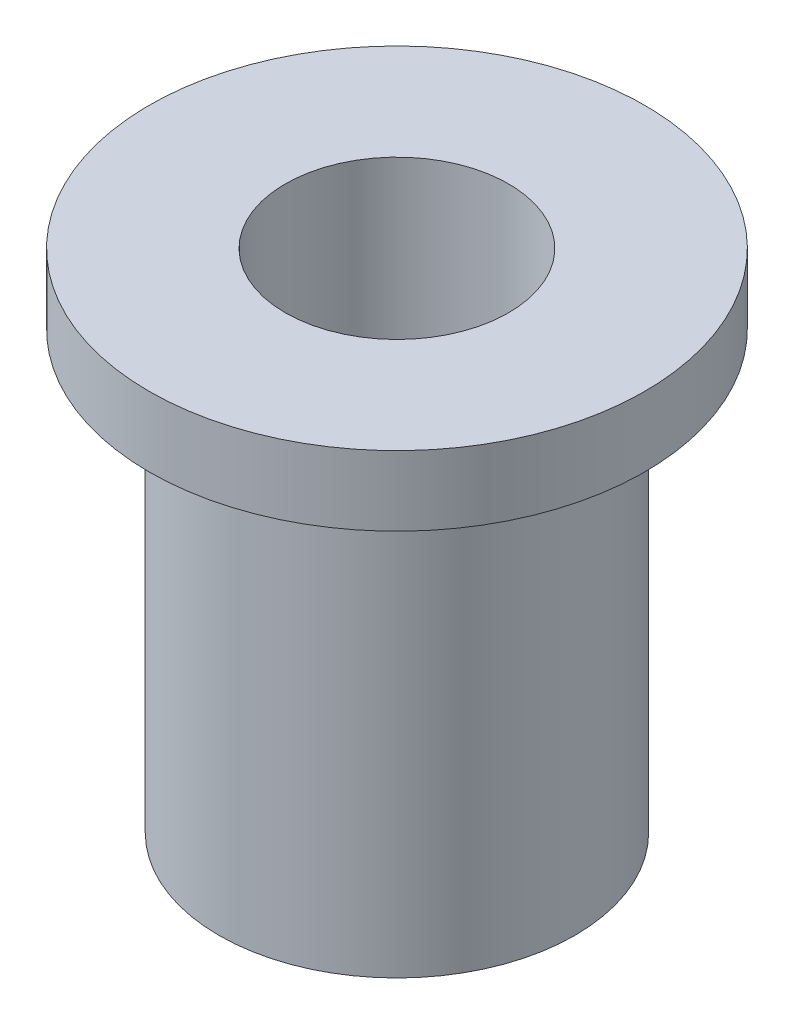
ISO-10303-21;
HEADER;
FILE_DESCRIPTION(('STEP AP214'),'2;1');
FILE_NAME('part.step','',(''),(''),'','','');
FILE_SCHEMA(('AUTOMOTIVE_DESIGN { 1 0 10303 214 1 1 1 1 }'));
ENDSEC;
DATA;
#1=APPLICATION_CONTEXT('core data for automotive mechanical design processes');
#2=APPLICATION_PROTOCOL_DEFINITION('international standard','automotive_design',2000,#1);
#3=PRODUCT_CONTEXT('',#1,'mechanical');
#4=PRODUCT('Part','Part','',(#3));
#5=PRODUCT_RELATED_PRODUCT_CATEGORY('part','',(#4));
#6=PRODUCT_DEFINITION_FORMATION('','',#4);
#7=PRODUCT_DEFINITION_CONTEXT('part definition',#1,'design');
#8=PRODUCT_DEFINITION('design','',#6,#7);
#9=PRODUCT_DEFINITION_SHAPE('','',#8);
#10=(LENGTH_UNIT() NAMED_UNIT(*) SI_UNIT(.MILLI.,.METRE.));
#11=(NAMED_UNIT(*) PLANE_ANGLE_UNIT() SI_UNIT($,.RADIAN.));
#12=(NAMED_UNIT(*) SI_UNIT($,.STERADIAN.) SOLID_ANGLE_UNIT());
#13=UNCERTAINTY_MEASURE_WITH_UNIT(LENGTH_MEASURE(1.E-05),#10,'distance_accuracy_value','');
#14=(GEOMETRIC_REPRESENTATION_CONTEXT(3) GLOBAL_UNCERTAINTY_ASSIGNED_CONTEXT((#13)) GLOBAL_UNIT_ASSIGNED_CONTEXT((#10,
#11,#12)) REPRESENTATION_CONTEXT('',''));
#15=CARTESIAN_POINT('',(0.,0.,0.));
#16=DIRECTION('',(0.,0.,1.));
#17=DIRECTION('',(1.,0.,0.));
#18=AXIS2_PLACEMENT_3D('',#15,#16,#17);
#19=CARTESIAN_POINT('',(0.,7.25,0.));
#20=DIRECTION('',(0.,-1.,0.));
#21=DIRECTION('',(0.,0.,-1.));
#22=AXIS2_PLACEMENT_3D('',#19,#20,#21);
#23=CYLINDRICAL_SURFACE('',#22,2.55);
#24=CARTESIAN_POINT('',(0.,0.,0.));
#25=DIRECTION('',(0.,1.,0.));
#26=DIRECTION('',(0.,0.,1.));
#27=AXIS2_PLACEMENT_3D('',#24,#25,#26);
#28=CIRCLE('',#27,2.55);
#29=CARTESIAN_POINT('',(0.,0.,2.55));
#30=VERTEX_POINT('',#29);
#31=EDGE_CURVE('E42',#30,#30,#28,.T.);
#32=ORIENTED_EDGE('',*,*,#31,.T.);
#33=EDGE_LOOP('',(#32));
#34=FACE_BOUND('',#33,.T.);
#35=CARTESIAN_POINT('',(0.,6.25,0.));
#36=DIRECTION('',(0.,1.,0.));
#37=DIRECTION('',(0.,0.,1.));
#38=AXIS2_PLACEMENT_3D('',#35,#36,#37);
#39=CIRCLE('',#38,2.55);
#40=CARTESIAN_POINT('',(0.,6.25,2.55));
#41=VERTEX_POINT('',#40);
#42=EDGE_CURVE('E10',#41,#41,#39,.T.);
#43=ORIENTED_EDGE('',*,*,#42,.F.);
#44=EDGE_LOOP('',(#43));
#45=FACE_BOUND('',#44,.T.);
#46=ADVANCED_FACE('F39',(#34,#45),#23,.T.);
#47=CARTESIAN_POINT('',(0.,7.25,0.));
#48=DIRECTION('',(0.,1.,0.));
#49=DIRECTION('',(0.,0.,1.));
#50=AXIS2_PLACEMENT_3D('',#47,#48,#49);
#51=PLANE('',#50);
#52=CARTESIAN_POINT('',(0.,7.25,0.));
#53=DIRECTION('',(0.,1.,0.));
#54=DIRECTION('',(0.,0.,1.));
#55=AXIS2_PLACEMENT_3D('',#52,#53,#54);
#56=CIRCLE('',#55,1.6);
#57=CARTESIAN_POINT('',(0.,7.25,1.6));
#58=VERTEX_POINT('',#57);
#59=EDGE_CURVE('E50',#58,#58,#56,.T.);
#60=ORIENTED_EDGE('',*,*,#59,.F.);
#61=EDGE_LOOP('',(#60));
#62=FACE_BOUND('',#61,.T.);
#63=CARTESIAN_POINT('',(0.,7.25,0.));
#64=DIRECTION('',(0.,1.,0.));
#65=DIRECTION('',(0.,0.,1.));
#66=AXIS2_PLACEMENT_3D('',#63,#64,#65);
#67=CIRCLE('',#66,3.55);
#68=CARTESIAN_POINT('',(0.,7.25,3.55));
#69=VERTEX_POINT('',#68);
#70=EDGE_CURVE('E53',#69,#69,#67,.T.);
#71=ORIENTED_EDGE('',*,*,#70,.T.);
#72=EDGE_LOOP('',(#71));
#73=FACE_BOUND('',#72,.T.);
#74=ADVANCED_FACE('F67',(#62,#73),#51,.T.);
#75=CARTESIAN_POINT('',(0.,0.,0.));
#76=DIRECTION('',(0.,1.,0.));
#77=DIRECTION('',(0.,0.,1.));
#78=AXIS2_PLACEMENT_3D('',#75,#76,#77);
#79=PLANE('',#78);
#80=ORIENTED_EDGE('',*,*,#31,.F.);
#81=EDGE_LOOP('',(#80));
#82=FACE_BOUND('',#81,.T.);
#83=CARTESIAN_POINT('',(0.,0.,0.));
#84=DIRECTION('',(0.,1.,0.));
#85=DIRECTION('',(0.,0.,1.));
#86=AXIS2_PLACEMENT_3D('',#83,#84,#85);
#87=CIRCLE('',#86,1.6);
#88=CARTESIAN_POINT('',(0.,0.,1.6));
#89=VERTEX_POINT('',#88);
#90=EDGE_CURVE('E56',#89,#89,#87,.T.);
#91=ORIENTED_EDGE('',*,*,#90,.T.);
#92=EDGE_LOOP('',(#91));
#93=FACE_BOUND('',#92,.T.);
#94=ADVANCED_FACE('F86',(#82,#93),#79,.F.);
#95=CARTESIAN_POINT('',(0.,7.25,0.));
#96=DIRECTION('',(0.,-1.,0.));
#97=DIRECTION('',(0.,0.,-1.));
#98=AXIS2_PLACEMENT_3D('',#95,#96,#97);
#99=CYLINDRICAL_SURFACE('',#98,1.6);
#100=ORIENTED_EDGE('',*,*,#59,.T.);
#101=EDGE_LOOP('',(#100));
#102=FACE_BOUND('',#101,.T.);
#103=ORIENTED_EDGE('',*,*,#90,.F.);
#104=EDGE_LOOP('',(#103));
#105=FACE_BOUND('',#104,.T.);
#106=ADVANCED_FACE('F76',(#102,#105),#99,.F.);
#107=CARTESIAN_POINT('',(0.,6.25,0.));
#108=DIRECTION('',(0.,1.,0.));
#109=DIRECTION('',(0.,0.,1.));
#110=AXIS2_PLACEMENT_3D('',#107,#108,#109);
#111=PLANE('',#110);
#112=CARTESIAN_POINT('',(0.,6.25,0.));
#113=DIRECTION('',(0.,1.,0.));
#114=DIRECTION('',(0.,0.,1.));
#115=AXIS2_PLACEMENT_3D('',#112,#113,#114);
#116=CIRCLE('',#115,3.55);
#117=CARTESIAN_POINT('',(0.,6.25,3.55));
#118=VERTEX_POINT('',#117);
#119=EDGE_CURVE('E58',#118,#118,#116,.T.);
#120=ORIENTED_EDGE('',*,*,#119,.F.);
#121=EDGE_LOOP('',(#120));
#122=FACE_BOUND('',#121,.T.);
#123=ORIENTED_EDGE('',*,*,#42,.T.);
#124=EDGE_LOOP('',(#123));
#125=FACE_BOUND('',#124,.T.);
#126=ADVANCED_FACE('F71',(#122,#125),#111,.F.);
#127=CARTESIAN_POINT('',(0.,6.25,0.));
#128=DIRECTION('',(0.,1.,0.));
#129=DIRECTION('',(0.,0.,1.));
#130=AXIS2_PLACEMENT_3D('',#127,#128,#129);
#131=CYLINDRICAL_SURFACE('',#130,3.55);
#132=ORIENTED_EDGE('',*,*,#119,.T.);
#133=EDGE_LOOP('',(#132));
#134=FACE_BOUND('',#133,.T.);
#135=ORIENTED_EDGE('',*,*,#70,.F.);
#136=EDGE_LOOP('',(#135));
#137=FACE_BOUND('',#136,.T.);
#138=ADVANCED_FACE('F69',(#134,#137),#131,.T.);
#139=CLOSED_SHELL('',(#46,#74,#94,#106,#126,#138));
#140=MANIFOLD_SOLID_BREP('B2',#139);
#141=ADVANCED_BREP_SHAPE_REPRESENTATION('',(#18,#140),#14);
#142=SHAPE_DEFINITION_REPRESENTATION(#9,#141);
ENDSEC;
END-ISO-10303-21;
